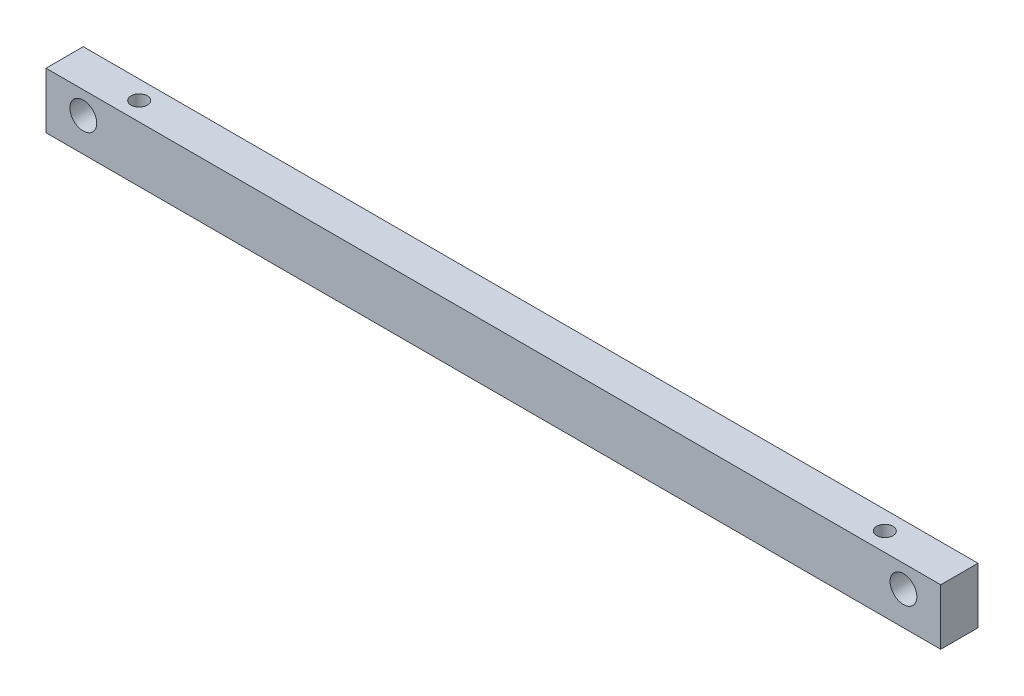
ISO-10303-21;
HEADER;
FILE_DESCRIPTION(('STEP AP214'),'2;1');
FILE_NAME('part.step','',(''),(''),'','','');
FILE_SCHEMA(('AUTOMOTIVE_DESIGN { 1 0 10303 214 1 1 1 1 }'));
ENDSEC;
DATA;
#1=APPLICATION_CONTEXT('core data for automotive mechanical design processes');
#2=APPLICATION_PROTOCOL_DEFINITION('international standard','automotive_design',2000,#1);
#3=PRODUCT_CONTEXT('',#1,'mechanical');
#4=PRODUCT('Part','Part','',(#3));
#5=PRODUCT_RELATED_PRODUCT_CATEGORY('part','',(#4));
#6=PRODUCT_DEFINITION_FORMATION('','',#4);
#7=PRODUCT_DEFINITION_CONTEXT('part definition',#1,'design');
#8=PRODUCT_DEFINITION('design','',#6,#7);
#9=PRODUCT_DEFINITION_SHAPE('','',#8);
#10=(LENGTH_UNIT() NAMED_UNIT(*) SI_UNIT(.MILLI.,.METRE.));
#11=(NAMED_UNIT(*) PLANE_ANGLE_UNIT() SI_UNIT($,.RADIAN.));
#12=(NAMED_UNIT(*) SI_UNIT($,.STERADIAN.) SOLID_ANGLE_UNIT());
#13=UNCERTAINTY_MEASURE_WITH_UNIT(LENGTH_MEASURE(1.E-05),#10,'distance_accuracy_value','');
#14=(GEOMETRIC_REPRESENTATION_CONTEXT(3) GLOBAL_UNCERTAINTY_ASSIGNED_CONTEXT((#13)) GLOBAL_UNIT_ASSIGNED_CONTEXT((#10,
#11,#12)) REPRESENTATION_CONTEXT('',''));
#15=CARTESIAN_POINT('',(0.,0.,0.));
#16=DIRECTION('',(0.,0.,1.));
#17=DIRECTION('',(1.,0.,0.));
#18=AXIS2_PLACEMENT_3D('',#15,#16,#17);
#19=CARTESIAN_POINT('',(152.4,9.525,-6.35));
#20=DIRECTION('',(0.,0.,1.));
#21=DIRECTION('',(0.,-1.,0.));
#22=AXIS2_PLACEMENT_3D('',#19,#20,#21);
#23=PLANE('',#22);
#24=CARTESIAN_POINT('',(139.7,1.90500000000003,-6.35));
#25=DIRECTION('',(0.,0.,1.));
#26=DIRECTION('',(1.,0.,0.));
#27=AXIS2_PLACEMENT_3D('',#24,#25,#26);
#28=CIRCLE('',#27,4.5640625);
#29=CARTESIAN_POINT('',(144.2640625,1.90500000000003,-6.35));
#30=VERTEX_POINT('',#29);
#31=EDGE_CURVE('E128',#30,#30,#28,.T.);
#32=ORIENTED_EDGE('',*,*,#31,.T.);
#33=EDGE_LOOP('',(#32));
#34=FACE_BOUND('',#33,.T.);
#35=CARTESIAN_POINT('',(-139.7,1.905,-6.35));
#36=DIRECTION('',(0.,0.,1.));
#37=DIRECTION('',(1.,0.,0.));
#38=AXIS2_PLACEMENT_3D('',#35,#36,#37);
#39=CIRCLE('',#38,4.5640625);
#40=CARTESIAN_POINT('',(-135.1359375,1.905,-6.35));
#41=VERTEX_POINT('',#40);
#42=EDGE_CURVE('E135',#41,#41,#39,.T.);
#43=ORIENTED_EDGE('',*,*,#42,.T.);
#44=EDGE_LOOP('',(#43));
#45=FACE_BOUND('',#44,.T.);
#46=DIRECTION('',(0.,1.,0.));
#47=VECTOR('',#46,1.);
#48=CARTESIAN_POINT('',(-152.4,9.525,-6.35));
#49=LINE('',#48,#47);
#50=CARTESIAN_POINT('',(-152.4,-9.525,-6.35));
#51=VERTEX_POINT('',#50);
#52=CARTESIAN_POINT('',(-152.4,9.525,-6.35));
#53=VERTEX_POINT('',#52);
#54=EDGE_CURVE('E112',#51,#53,#49,.T.);
#55=ORIENTED_EDGE('',*,*,#54,.T.);
#56=DIRECTION('',(-1.,0.,0.));
#57=VECTOR('',#56,1.);
#58=CARTESIAN_POINT('',(152.4,9.525,-6.35));
#59=LINE('',#58,#57);
#60=CARTESIAN_POINT('',(152.4,9.525,-6.35));
#61=VERTEX_POINT('',#60);
#62=EDGE_CURVE('E11',#61,#53,#59,.T.);
#63=ORIENTED_EDGE('',*,*,#62,.F.);
#64=DIRECTION('',(0.,1.,0.));
#65=VECTOR('',#64,1.);
#66=CARTESIAN_POINT('',(152.4,9.525,-6.35));
#67=LINE('',#66,#65);
#68=CARTESIAN_POINT('',(152.4,-9.525,-6.35));
#69=VERTEX_POINT('',#68);
#70=EDGE_CURVE('E95',#69,#61,#67,.T.);
#71=ORIENTED_EDGE('',*,*,#70,.F.);
#72=DIRECTION('',(-1.,0.,0.));
#73=VECTOR('',#72,1.);
#74=CARTESIAN_POINT('',(152.4,-9.525,-6.35));
#75=LINE('',#74,#73);
#76=EDGE_CURVE('E108',#69,#51,#75,.T.);
#77=ORIENTED_EDGE('',*,*,#76,.T.);
#78=EDGE_LOOP('',(#55,#63,#71,#77));
#79=FACE_BOUND('',#78,.T.);
#80=ADVANCED_FACE('F41',(#34,#45,#79),#23,.F.);
#81=CARTESIAN_POINT('',(152.4,9.525,6.35));
#82=DIRECTION('',(0.,-1.,0.));
#83=DIRECTION('',(0.,0.,-1.));
#84=AXIS2_PLACEMENT_3D('',#81,#82,#83);
#85=PLANE('',#84);
#86=CARTESIAN_POINT('',(-127.,9.525,0.));
#87=DIRECTION('',(0.,-1.,0.));
#88=DIRECTION('',(0.,0.,-1.));
#89=AXIS2_PLACEMENT_3D('',#86,#87,#88);
#90=CIRCLE('',#89,2.77812499999999);
#91=CARTESIAN_POINT('',(-127.,9.525,-2.77812499999999));
#92=VERTEX_POINT('',#91);
#93=EDGE_CURVE('E141',#92,#92,#90,.T.);
#94=ORIENTED_EDGE('',*,*,#93,.T.);
#95=EDGE_LOOP('',(#94));
#96=FACE_BOUND('',#95,.T.);
#97=CARTESIAN_POINT('',(127.,9.525,0.));
#98=DIRECTION('',(0.,-1.,0.));
#99=DIRECTION('',(0.,0.,-1.));
#100=AXIS2_PLACEMENT_3D('',#97,#98,#99);
#101=CIRCLE('',#100,2.77812499999999);
#102=CARTESIAN_POINT('',(127.,9.525,-2.77812500000002));
#103=VERTEX_POINT('',#102);
#104=EDGE_CURVE('E148',#103,#103,#101,.T.);
#105=ORIENTED_EDGE('',*,*,#104,.T.);
#106=EDGE_LOOP('',(#105));
#107=FACE_BOUND('',#106,.T.);
#108=DIRECTION('',(0.,0.,1.));
#109=VECTOR('',#108,1.);
#110=CARTESIAN_POINT('',(-152.4,9.525,6.35));
#111=LINE('',#110,#109);
#112=CARTESIAN_POINT('',(-152.4,9.525,6.35));
#113=VERTEX_POINT('',#112);
#114=EDGE_CURVE('E100',#53,#113,#111,.T.);
#115=ORIENTED_EDGE('',*,*,#114,.T.);
#116=DIRECTION('',(-1.,0.,0.));
#117=VECTOR('',#116,1.);
#118=CARTESIAN_POINT('',(152.4,9.525,6.35));
#119=LINE('',#118,#117);
#120=CARTESIAN_POINT('',(152.4,9.525,6.35));
#121=VERTEX_POINT('',#120);
#122=EDGE_CURVE('E51',#121,#113,#119,.T.);
#123=ORIENTED_EDGE('',*,*,#122,.F.);
#124=DIRECTION('',(0.,0.,1.));
#125=VECTOR('',#124,1.);
#126=CARTESIAN_POINT('',(152.4,9.525,6.35));
#127=LINE('',#126,#125);
#128=EDGE_CURVE('E90',#61,#121,#127,.T.);
#129=ORIENTED_EDGE('',*,*,#128,.F.);
#130=ORIENTED_EDGE('',*,*,#62,.T.);
#131=EDGE_LOOP('',(#115,#123,#129,#130));
#132=FACE_BOUND('',#131,.T.);
#133=ADVANCED_FACE('F99',(#96,#107,#132),#85,.F.);
#134=CARTESIAN_POINT('',(152.4,9.525,6.35));
#135=DIRECTION('',(0.,0.,-1.));
#136=DIRECTION('',(0.,1.,0.));
#137=AXIS2_PLACEMENT_3D('',#134,#135,#136);
#138=PLANE('',#137);
#139=CARTESIAN_POINT('',(139.7,1.90500000000003,6.35));
#140=DIRECTION('',(0.,0.,-1.));
#141=DIRECTION('',(0.,1.,0.));
#142=AXIS2_PLACEMENT_3D('',#139,#140,#141);
#143=CIRCLE('',#142,4.5640625);
#144=CARTESIAN_POINT('',(139.7,6.46906250000004,6.35));
#145=VERTEX_POINT('',#144);
#146=EDGE_CURVE('E44',#145,#145,#143,.T.);
#147=ORIENTED_EDGE('',*,*,#146,.T.);
#148=EDGE_LOOP('',(#147));
#149=FACE_BOUND('',#148,.T.);
#150=CARTESIAN_POINT('',(-139.7,1.905,6.35));
#151=DIRECTION('',(0.,0.,-1.));
#152=DIRECTION('',(0.,1.,0.));
#153=AXIS2_PLACEMENT_3D('',#150,#151,#152);
#154=CIRCLE('',#153,4.5640625);
#155=CARTESIAN_POINT('',(-139.7,6.4690625,6.35));
#156=VERTEX_POINT('',#155);
#157=EDGE_CURVE('E125',#156,#156,#154,.T.);
#158=ORIENTED_EDGE('',*,*,#157,.T.);
#159=EDGE_LOOP('',(#158));
#160=FACE_BOUND('',#159,.T.);
#161=DIRECTION('',(0.,-1.,0.));
#162=VECTOR('',#161,1.);
#163=CARTESIAN_POINT('',(-152.4,9.525,6.35));
#164=LINE('',#163,#162);
#165=CARTESIAN_POINT('',(-152.4,-9.525,6.35));
#166=VERTEX_POINT('',#165);
#167=EDGE_CURVE('E77',#113,#166,#164,.T.);
#168=ORIENTED_EDGE('',*,*,#167,.T.);
#169=DIRECTION('',(-1.,0.,0.));
#170=VECTOR('',#169,1.);
#171=CARTESIAN_POINT('',(152.4,-9.525,6.35));
#172=LINE('',#171,#170);
#173=CARTESIAN_POINT('',(152.4,-9.525,6.35));
#174=VERTEX_POINT('',#173);
#175=EDGE_CURVE('E102',#174,#166,#172,.T.);
#176=ORIENTED_EDGE('',*,*,#175,.F.);
#177=DIRECTION('',(0.,-1.,0.));
#178=VECTOR('',#177,1.);
#179=CARTESIAN_POINT('',(152.4,9.525,6.35));
#180=LINE('',#179,#178);
#181=EDGE_CURVE('E93',#121,#174,#180,.T.);
#182=ORIENTED_EDGE('',*,*,#181,.F.);
#183=ORIENTED_EDGE('',*,*,#122,.T.);
#184=EDGE_LOOP('',(#168,#176,#182,#183));
#185=FACE_BOUND('',#184,.T.);
#186=ADVANCED_FACE('F104',(#149,#160,#185),#138,.F.);
#187=CARTESIAN_POINT('',(152.4,-9.525,6.35));
#188=DIRECTION('',(0.,1.,0.));
#189=DIRECTION('',(0.,0.,1.));
#190=AXIS2_PLACEMENT_3D('',#187,#188,#189);
#191=PLANE('',#190);
#192=CARTESIAN_POINT('',(-127.,-9.525,0.));
#193=DIRECTION('',(0.,1.,0.));
#194=DIRECTION('',(0.,0.,1.));
#195=AXIS2_PLACEMENT_3D('',#192,#193,#194);
#196=CIRCLE('',#195,2.77812499999999);
#197=CARTESIAN_POINT('',(-127.,-9.525,2.77812499999999));
#198=VERTEX_POINT('',#197);
#199=EDGE_CURVE('E152',#198,#198,#196,.T.);
#200=ORIENTED_EDGE('',*,*,#199,.T.);
#201=EDGE_LOOP('',(#200));
#202=FACE_BOUND('',#201,.T.);
#203=CARTESIAN_POINT('',(127.,-9.525,0.));
#204=DIRECTION('',(0.,1.,0.));
#205=DIRECTION('',(0.,0.,1.));
#206=AXIS2_PLACEMENT_3D('',#203,#204,#205);
#207=CIRCLE('',#206,2.77812499999999);
#208=CARTESIAN_POINT('',(127.,-9.525,2.77812499999996));
#209=VERTEX_POINT('',#208);
#210=EDGE_CURVE('E153',#209,#209,#207,.T.);
#211=ORIENTED_EDGE('',*,*,#210,.T.);
#212=EDGE_LOOP('',(#211));
#213=FACE_BOUND('',#212,.T.);
#214=DIRECTION('',(0.,0.,-1.));
#215=VECTOR('',#214,1.);
#216=CARTESIAN_POINT('',(-152.4,-9.525,6.35));
#217=LINE('',#216,#215);
#218=EDGE_CURVE('E83',#166,#51,#217,.T.);
#219=ORIENTED_EDGE('',*,*,#218,.T.);
#220=ORIENTED_EDGE('',*,*,#76,.F.);
#221=DIRECTION('',(0.,0.,-1.));
#222=VECTOR('',#221,1.);
#223=CARTESIAN_POINT('',(152.4,-9.525,6.35));
#224=LINE('',#223,#222);
#225=EDGE_CURVE('E60',#174,#69,#224,.T.);
#226=ORIENTED_EDGE('',*,*,#225,.F.);
#227=ORIENTED_EDGE('',*,*,#175,.T.);
#228=EDGE_LOOP('',(#219,#220,#226,#227));
#229=FACE_BOUND('',#228,.T.);
#230=ADVANCED_FACE('F161',(#202,#213,#229),#191,.F.);
#231=CARTESIAN_POINT('',(152.4,0.,0.));
#232=DIRECTION('',(1.,0.,0.));
#233=DIRECTION('',(0.,0.,-1.));
#234=AXIS2_PLACEMENT_3D('',#231,#232,#233);
#235=PLANE('',#234);
#236=ORIENTED_EDGE('',*,*,#70,.T.);
#237=ORIENTED_EDGE('',*,*,#128,.T.);
#238=ORIENTED_EDGE('',*,*,#181,.T.);
#239=ORIENTED_EDGE('',*,*,#225,.T.);
#240=EDGE_LOOP('',(#236,#237,#238,#239));
#241=FACE_BOUND('',#240,.T.);
#242=ADVANCED_FACE('F91',(#241),#235,.T.);
#243=CARTESIAN_POINT('',(-152.4,0.,0.));
#244=DIRECTION('',(1.,0.,0.));
#245=DIRECTION('',(0.,0.,-1.));
#246=AXIS2_PLACEMENT_3D('',#243,#244,#245);
#247=PLANE('',#246);
#248=ORIENTED_EDGE('',*,*,#54,.F.);
#249=ORIENTED_EDGE('',*,*,#218,.F.);
#250=ORIENTED_EDGE('',*,*,#167,.F.);
#251=ORIENTED_EDGE('',*,*,#114,.F.);
#252=EDGE_LOOP('',(#248,#249,#250,#251));
#253=FACE_BOUND('',#252,.T.);
#254=ADVANCED_FACE('F194',(#253),#247,.F.);
#255=CARTESIAN_POINT('',(-139.7,1.905,-6.35));
#256=DIRECTION('',(0.,0.,1.));
#257=DIRECTION('',(1.,0.,0.));
#258=AXIS2_PLACEMENT_3D('',#255,#256,#257);
#259=CYLINDRICAL_SURFACE('',#258,4.5640625);
#260=ORIENTED_EDGE('',*,*,#42,.F.);
#261=EDGE_LOOP('',(#260));
#262=FACE_BOUND('',#261,.T.);
#263=ORIENTED_EDGE('',*,*,#157,.F.);
#264=EDGE_LOOP('',(#263));
#265=FACE_BOUND('',#264,.T.);
#266=ADVANCED_FACE('F182',(#262,#265),#259,.F.);
#267=CARTESIAN_POINT('',(139.7,1.90500000000003,-6.35));
#268=DIRECTION('',(0.,0.,1.));
#269=DIRECTION('',(1.,0.,0.));
#270=AXIS2_PLACEMENT_3D('',#267,#268,#269);
#271=CYLINDRICAL_SURFACE('',#270,4.5640625);
#272=ORIENTED_EDGE('',*,*,#31,.F.);
#273=EDGE_LOOP('',(#272));
#274=FACE_BOUND('',#273,.T.);
#275=ORIENTED_EDGE('',*,*,#146,.F.);
#276=EDGE_LOOP('',(#275));
#277=FACE_BOUND('',#276,.T.);
#278=ADVANCED_FACE('F176',(#274,#277),#271,.F.);
#279=CARTESIAN_POINT('',(127.,-9.525,0.));
#280=DIRECTION('',(0.,1.,0.));
#281=DIRECTION('',(0.,0.,1.));
#282=AXIS2_PLACEMENT_3D('',#279,#280,#281);
#283=CYLINDRICAL_SURFACE('',#282,2.77812499999999);
#284=ORIENTED_EDGE('',*,*,#210,.F.);
#285=EDGE_LOOP('',(#284));
#286=FACE_BOUND('',#285,.T.);
#287=ORIENTED_EDGE('',*,*,#104,.F.);
#288=EDGE_LOOP('',(#287));
#289=FACE_BOUND('',#288,.T.);
#290=ADVANCED_FACE('F167',(#286,#289),#283,.F.);
#291=CARTESIAN_POINT('',(-127.,-9.525,0.));
#292=DIRECTION('',(0.,1.,0.));
#293=DIRECTION('',(0.,0.,1.));
#294=AXIS2_PLACEMENT_3D('',#291,#292,#293);
#295=CYLINDRICAL_SURFACE('',#294,2.77812499999999);
#296=ORIENTED_EDGE('',*,*,#199,.F.);
#297=EDGE_LOOP('',(#296));
#298=FACE_BOUND('',#297,.T.);
#299=ORIENTED_EDGE('',*,*,#93,.F.);
#300=EDGE_LOOP('',(#299));
#301=FACE_BOUND('',#300,.T.);
#302=ADVANCED_FACE('F164',(#298,#301),#295,.F.);
#303=CLOSED_SHELL('',(#80,#133,#186,#230,#242,#254,#266,#278,#290,#302));
#304=MANIFOLD_SOLID_BREP('B2',#303);
#305=ADVANCED_BREP_SHAPE_REPRESENTATION('',(#18,#304),#14);
#306=SHAPE_DEFINITION_REPRESENTATION(#9,#305);
ENDSEC;
END-ISO-10303-21;
